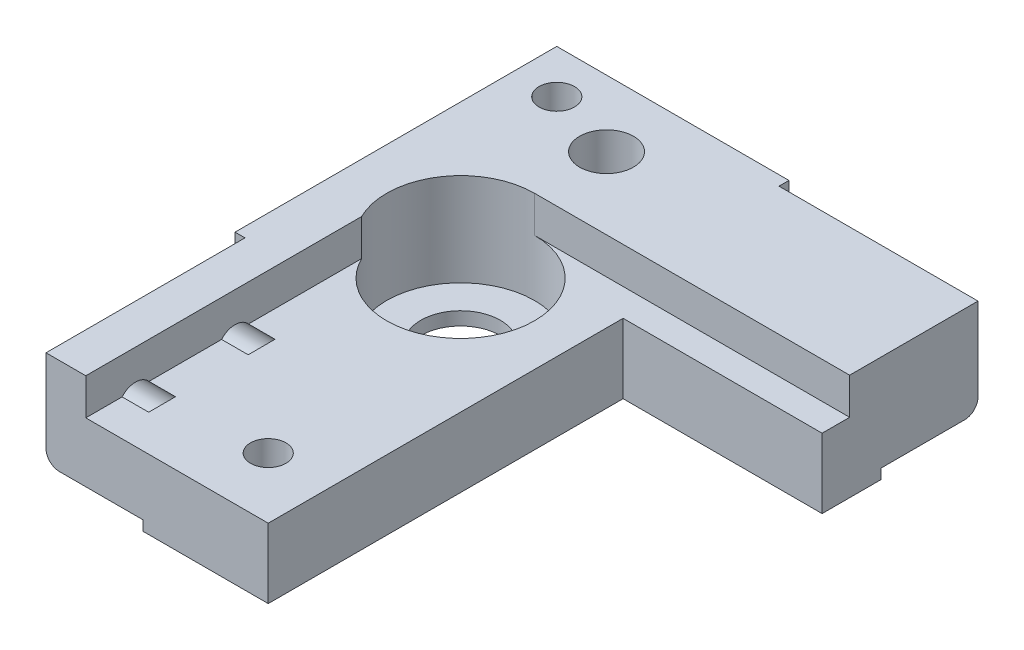
ISO-10303-21;
HEADER;
FILE_DESCRIPTION(('STEP AP214'),'2;1');
FILE_NAME('part.step','',(''),(''),'','','');
FILE_SCHEMA(('AUTOMOTIVE_DESIGN { 1 0 10303 214 1 1 1 1 }'));
ENDSEC;
DATA;
#1=APPLICATION_CONTEXT('core data for automotive mechanical design processes');
#2=APPLICATION_PROTOCOL_DEFINITION('international standard','automotive_design',2000,#1);
#3=PRODUCT_CONTEXT('',#1,'mechanical');
#4=PRODUCT('Part','Part','',(#3));
#5=PRODUCT_RELATED_PRODUCT_CATEGORY('part','',(#4));
#6=PRODUCT_DEFINITION_FORMATION('','',#4);
#7=PRODUCT_DEFINITION_CONTEXT('part definition',#1,'design');
#8=PRODUCT_DEFINITION('design','',#6,#7);
#9=PRODUCT_DEFINITION_SHAPE('','',#8);
#10=(LENGTH_UNIT() NAMED_UNIT(*) SI_UNIT(.MILLI.,.METRE.));
#11=(NAMED_UNIT(*) PLANE_ANGLE_UNIT() SI_UNIT($,.RADIAN.));
#12=(NAMED_UNIT(*) SI_UNIT($,.STERADIAN.) SOLID_ANGLE_UNIT());
#13=UNCERTAINTY_MEASURE_WITH_UNIT(LENGTH_MEASURE(1.E-05),#10,'distance_accuracy_value','');
#14=(GEOMETRIC_REPRESENTATION_CONTEXT(3) GLOBAL_UNCERTAINTY_ASSIGNED_CONTEXT((#13)) GLOBAL_UNIT_ASSIGNED_CONTEXT((#10,
#11,#12)) REPRESENTATION_CONTEXT('',''));
#15=CARTESIAN_POINT('',(0.,0.,0.));
#16=DIRECTION('',(0.,0.,1.));
#17=DIRECTION('',(1.,0.,0.));
#18=AXIS2_PLACEMENT_3D('',#15,#16,#17);
#19=CARTESIAN_POINT('',(35.,16.,78.5));
#20=DIRECTION('',(-1.,0.,0.));
#21=DIRECTION('',(0.,0.,1.));
#22=AXIS2_PLACEMENT_3D('',#19,#20,#21);
#23=PLANE('',#22);
#24=DIRECTION('',(0.,0.,-1.));
#25=VECTOR('',#24,1.);
#26=CARTESIAN_POINT('',(35.,10.5,78.5));
#27=LINE('',#26,#25);
#28=CARTESIAN_POINT('',(35.,10.5,78.5));
#29=VERTEX_POINT('',#28);
#30=CARTESIAN_POINT('',(35.,10.5,25.));
#31=VERTEX_POINT('',#30);
#32=EDGE_CURVE('E195',#29,#31,#27,.T.);
#33=ORIENTED_EDGE('',*,*,#32,.F.);
#34=DIRECTION('',(0.,-1.,0.));
#35=VECTOR('',#34,1.);
#36=CARTESIAN_POINT('',(35.,16.,78.5));
#37=LINE('',#36,#35);
#38=CARTESIAN_POINT('',(35.,0.,78.5));
#39=VERTEX_POINT('',#38);
#40=EDGE_CURVE('E220',#29,#39,#37,.T.);
#41=ORIENTED_EDGE('',*,*,#40,.T.);
#42=DIRECTION('',(0.,0.,-1.));
#43=VECTOR('',#42,1.);
#44=CARTESIAN_POINT('',(35.,0.,78.5));
#45=LINE('',#44,#43);
#46=CARTESIAN_POINT('',(35.,0.,25.));
#47=VERTEX_POINT('',#46);
#48=EDGE_CURVE('E218',#39,#47,#45,.T.);
#49=ORIENTED_EDGE('',*,*,#48,.T.);
#50=DIRECTION('',(0.,-1.,0.));
#51=VECTOR('',#50,1.);
#52=CARTESIAN_POINT('',(35.,16.,25.));
#53=LINE('',#52,#51);
#54=EDGE_CURVE('E212',#31,#47,#53,.T.);
#55=ORIENTED_EDGE('',*,*,#54,.F.);
#56=EDGE_LOOP('',(#33,#41,#49,#55));
#57=FACE_BOUND('',#56,.T.);
#58=ADVANCED_FACE('F34',(#57),#23,.F.);
#59=CARTESIAN_POINT('',(35.,16.,25.));
#60=DIRECTION('',(0.,0.,-1.));
#61=DIRECTION('',(-1.,0.,0.));
#62=AXIS2_PLACEMENT_3D('',#59,#60,#61);
#63=PLANE('',#62);
#64=DIRECTION('',(1.,0.,0.));
#65=VECTOR('',#64,1.);
#66=CARTESIAN_POINT('',(65.,10.5,25.));
#67=LINE('',#66,#65);
#68=CARTESIAN_POINT('',(65.,10.5,25.));
#69=VERTEX_POINT('',#68);
#70=EDGE_CURVE('E199',#31,#69,#67,.T.);
#71=ORIENTED_EDGE('',*,*,#70,.F.);
#72=ORIENTED_EDGE('',*,*,#54,.T.);
#73=DIRECTION('',(1.,0.,0.));
#74=VECTOR('',#73,1.);
#75=CARTESIAN_POINT('',(35.,0.,25.));
#76=LINE('',#75,#74);
#77=CARTESIAN_POINT('',(65.,0.,25.));
#78=VERTEX_POINT('',#77);
#79=EDGE_CURVE('E336',#47,#78,#76,.T.);
#80=ORIENTED_EDGE('',*,*,#79,.T.);
#81=DIRECTION('',(0.,-1.,0.));
#82=VECTOR('',#81,1.);
#83=CARTESIAN_POINT('',(65.,16.,25.));
#84=LINE('',#83,#82);
#85=EDGE_CURVE('E214',#69,#78,#84,.T.);
#86=ORIENTED_EDGE('',*,*,#85,.F.);
#87=EDGE_LOOP('',(#71,#72,#80,#86));
#88=FACE_BOUND('',#87,.T.);
#89=ADVANCED_FACE('F210',(#88),#63,.F.);
#90=CARTESIAN_POINT('',(11.5,8.75,56.));
#91=DIRECTION('',(-1.,0.,0.));
#92=DIRECTION('',(0.,-1.,0.));
#93=AXIS2_PLACEMENT_3D('',#90,#91,#92);
#94=CYLINDRICAL_SURFACE('',#93,2.675);
#95=CARTESIAN_POINT('',(1.5,8.75,56.));
#96=DIRECTION('',(-1.,0.,0.));
#97=DIRECTION('',(0.,-1.,0.));
#98=AXIS2_PLACEMENT_3D('',#95,#96,#97);
#99=CIRCLE('',#98,2.675);
#100=CARTESIAN_POINT('',(1.5,6.075,56.));
#101=VERTEX_POINT('',#100);
#102=EDGE_CURVE('E370',#101,#101,#99,.T.);
#103=ORIENTED_EDGE('',*,*,#102,.T.);
#104=EDGE_LOOP('',(#103));
#105=FACE_BOUND('',#104,.T.);
#106=DIRECTION('',(-1.,0.,0.));
#107=VECTOR('',#106,1.);
#108=CARTESIAN_POINT('',(11.5,10.5,53.9768526993815));
#109=LINE('',#108,#107);
#110=CARTESIAN_POINT('',(7.50000000000001,10.5,53.9768526993815));
#111=VERTEX_POINT('',#110);
#112=CARTESIAN_POINT('',(11.5,10.5,53.9768526993815));
#113=VERTEX_POINT('',#112);
#114=EDGE_CURVE('E600',#111,#113,#109,.F.);
#115=ORIENTED_EDGE('',*,*,#114,.F.);
#116=CARTESIAN_POINT('',(7.50000000000001,8.75,56.));
#117=DIRECTION('',(-1.,0.,0.));
#118=DIRECTION('',(0.,0.,1.));
#119=AXIS2_PLACEMENT_3D('',#116,#117,#118);
#120=CIRCLE('',#119,2.675);
#121=CARTESIAN_POINT('',(7.50000000000001,10.5,58.0231473006185));
#122=VERTEX_POINT('',#121);
#123=EDGE_CURVE('E604',#111,#122,#120,.F.);
#124=ORIENTED_EDGE('',*,*,#123,.T.);
#125=DIRECTION('',(-1.,0.,0.));
#126=VECTOR('',#125,1.);
#127=CARTESIAN_POINT('',(11.5,10.5,58.0231473006185));
#128=LINE('',#127,#126);
#129=CARTESIAN_POINT('',(11.5,10.5,58.0231473006185));
#130=VERTEX_POINT('',#129);
#131=EDGE_CURVE('E598',#130,#122,#128,.T.);
#132=ORIENTED_EDGE('',*,*,#131,.F.);
#133=CARTESIAN_POINT('',(11.5,8.75,56.));
#134=DIRECTION('',(-1.,0.,0.));
#135=DIRECTION('',(0.,-1.,0.));
#136=AXIS2_PLACEMENT_3D('',#133,#134,#135);
#137=CIRCLE('',#136,2.675);
#138=EDGE_CURVE('E381',#113,#130,#137,.T.);
#139=ORIENTED_EDGE('',*,*,#138,.F.);
#140=EDGE_LOOP('',(#115,#124,#132,#139));
#141=FACE_BOUND('',#140,.T.);
#142=ADVANCED_FACE('F421',(#105,#141),#94,.F.);
#143=CARTESIAN_POINT('',(11.5,8.75,56.));
#144=DIRECTION('',(-1.,0.,0.));
#145=DIRECTION('',(0.,-1.,0.));
#146=AXIS2_PLACEMENT_3D('',#143,#144,#145);
#147=PLANE('',#146);
#148=ORIENTED_EDGE('',*,*,#138,.T.);
#149=DIRECTION('',(0.,0.,-1.));
#150=VECTOR('',#149,1.);
#151=CARTESIAN_POINT('',(11.5,10.5,56.));
#152=LINE('',#151,#150);
#153=EDGE_CURVE('E596',#130,#113,#152,.T.);
#154=ORIENTED_EDGE('',*,*,#153,.T.);
#155=EDGE_LOOP('',(#148,#154));
#156=FACE_BOUND('',#155,.T.);
#157=ADVANCED_FACE('F460',(#156),#147,.T.);
#158=CARTESIAN_POINT('',(11.5,8.75,71.));
#159=DIRECTION('',(-1.,0.,0.));
#160=DIRECTION('',(0.,-1.,0.));
#161=AXIS2_PLACEMENT_3D('',#158,#159,#160);
#162=CYLINDRICAL_SURFACE('',#161,2.675);
#163=CARTESIAN_POINT('',(1.5,8.75,71.));
#164=DIRECTION('',(-1.,0.,0.));
#165=DIRECTION('',(0.,-1.,0.));
#166=AXIS2_PLACEMENT_3D('',#163,#164,#165);
#167=CIRCLE('',#166,2.675);
#168=CARTESIAN_POINT('',(1.5,6.075,71.));
#169=VERTEX_POINT('',#168);
#170=EDGE_CURVE('E546',#169,#169,#167,.T.);
#171=ORIENTED_EDGE('',*,*,#170,.T.);
#172=EDGE_LOOP('',(#171));
#173=FACE_BOUND('',#172,.T.);
#174=DIRECTION('',(-1.,0.,0.));
#175=VECTOR('',#174,1.);
#176=CARTESIAN_POINT('',(11.5,10.5,68.9768526993815));
#177=LINE('',#176,#175);
#178=CARTESIAN_POINT('',(7.50000000000001,10.5,68.9768526993815));
#179=VERTEX_POINT('',#178);
#180=CARTESIAN_POINT('',(11.5,10.5,68.9768526993815));
#181=VERTEX_POINT('',#180);
#182=EDGE_CURVE('E594',#179,#181,#177,.F.);
#183=ORIENTED_EDGE('',*,*,#182,.F.);
#184=CARTESIAN_POINT('',(7.50000000000001,8.75,71.));
#185=DIRECTION('',(-1.,0.,0.));
#186=DIRECTION('',(0.,0.,1.));
#187=AXIS2_PLACEMENT_3D('',#184,#185,#186);
#188=CIRCLE('',#187,2.675);
#189=CARTESIAN_POINT('',(7.50000000000001,10.5,73.0231473006185));
#190=VERTEX_POINT('',#189);
#191=EDGE_CURVE('E233',#179,#190,#188,.F.);
#192=ORIENTED_EDGE('',*,*,#191,.T.);
#193=DIRECTION('',(-1.,0.,0.));
#194=VECTOR('',#193,1.);
#195=CARTESIAN_POINT('',(11.5,10.5,73.0231473006185));
#196=LINE('',#195,#194);
#197=CARTESIAN_POINT('',(11.5,10.5,73.0231473006185));
#198=VERTEX_POINT('',#197);
#199=EDGE_CURVE('E592',#198,#190,#196,.T.);
#200=ORIENTED_EDGE('',*,*,#199,.F.);
#201=CARTESIAN_POINT('',(11.5,8.75,71.));
#202=DIRECTION('',(-1.,0.,0.));
#203=DIRECTION('',(0.,-1.,0.));
#204=AXIS2_PLACEMENT_3D('',#201,#202,#203);
#205=CIRCLE('',#204,2.675);
#206=EDGE_CURVE('E550',#181,#198,#205,.T.);
#207=ORIENTED_EDGE('',*,*,#206,.F.);
#208=EDGE_LOOP('',(#183,#192,#200,#207));
#209=FACE_BOUND('',#208,.T.);
#210=ADVANCED_FACE('F456',(#173,#209),#162,.F.);
#211=CARTESIAN_POINT('',(11.5,8.75,71.));
#212=DIRECTION('',(-1.,0.,0.));
#213=DIRECTION('',(0.,-1.,0.));
#214=AXIS2_PLACEMENT_3D('',#211,#212,#213);
#215=PLANE('',#214);
#216=ORIENTED_EDGE('',*,*,#206,.T.);
#217=DIRECTION('',(0.,0.,-1.));
#218=VECTOR('',#217,1.);
#219=CARTESIAN_POINT('',(11.5,10.5,71.));
#220=LINE('',#219,#218);
#221=EDGE_CURVE('E237',#198,#181,#220,.T.);
#222=ORIENTED_EDGE('',*,*,#221,.T.);
#223=EDGE_LOOP('',(#216,#222));
#224=FACE_BOUND('',#223,.T.);
#225=ADVANCED_FACE('F447',(#224),#215,.T.);
#226=CARTESIAN_POINT('',(25.8455481504227,0.,69.3455481504227));
#227=DIRECTION('',(0.,1.,0.));
#228=DIRECTION('',(0.,0.,1.));
#229=AXIS2_PLACEMENT_3D('',#226,#227,#228);
#230=CYLINDRICAL_SURFACE('',#229,2.675);
#231=CARTESIAN_POINT('',(25.8455481504227,0.,69.3455481504227));
#232=DIRECTION('',(0.,1.,0.));
#233=DIRECTION('',(0.,0.,1.));
#234=AXIS2_PLACEMENT_3D('',#231,#232,#233);
#235=CIRCLE('',#234,2.675);
#236=CARTESIAN_POINT('',(25.8455481504227,0.,72.0205481504227));
#237=VERTEX_POINT('',#236);
#238=EDGE_CURVE('E530',#237,#237,#235,.T.);
#239=ORIENTED_EDGE('',*,*,#238,.F.);
#240=EDGE_LOOP('',(#239));
#241=FACE_BOUND('',#240,.T.);
#242=CARTESIAN_POINT('',(25.8455481504227,10.5,69.3455481504227));
#243=DIRECTION('',(0.,1.,0.));
#244=DIRECTION('',(0.,0.,1.));
#245=AXIS2_PLACEMENT_3D('',#242,#243,#244);
#246=CIRCLE('',#245,2.675);
#247=CARTESIAN_POINT('',(25.8455481504227,10.5,72.0205481504227));
#248=VERTEX_POINT('',#247);
#249=EDGE_CURVE('E234',#248,#248,#246,.F.);
#250=ORIENTED_EDGE('',*,*,#249,.F.);
#251=EDGE_LOOP('',(#250));
#252=FACE_BOUND('',#251,.T.);
#253=ADVANCED_FACE('F427',(#241,#252),#230,.F.);
#254=CARTESIAN_POINT('',(0.,16.,0.));
#255=DIRECTION('',(1.,0.,0.));
#256=DIRECTION('',(0.,0.,-1.));
#257=AXIS2_PLACEMENT_3D('',#254,#255,#256);
#258=PLANE('',#257);
#259=DIRECTION('',(0.,0.,1.));
#260=VECTOR('',#259,1.);
#261=CARTESIAN_POINT('',(0.,0.,0.));
#262=LINE('',#261,#260);
#263=CARTESIAN_POINT('',(0.,0.,0.));
#264=VERTEX_POINT('',#263);
#265=CARTESIAN_POINT('',(0.,0.,48.5));
#266=VERTEX_POINT('',#265);
#267=EDGE_CURVE('E317',#264,#266,#262,.T.);
#268=ORIENTED_EDGE('',*,*,#267,.T.);
#269=DIRECTION('',(0.,-1.,0.));
#270=VECTOR('',#269,1.);
#271=CARTESIAN_POINT('',(0.,0.,48.5));
#272=LINE('',#271,#270);
#273=CARTESIAN_POINT('',(0.,16.,48.5));
#274=VERTEX_POINT('',#273);
#275=EDGE_CURVE('E376',#274,#266,#272,.T.);
#276=ORIENTED_EDGE('',*,*,#275,.F.);
#277=DIRECTION('',(0.,0.,1.));
#278=VECTOR('',#277,1.);
#279=CARTESIAN_POINT('',(0.,16.,0.));
#280=LINE('',#279,#278);
#281=CARTESIAN_POINT('',(0.,16.,0.));
#282=VERTEX_POINT('',#281);
#283=EDGE_CURVE('E319',#282,#274,#280,.T.);
#284=ORIENTED_EDGE('',*,*,#283,.F.);
#285=DIRECTION('',(0.,-1.,0.));
#286=VECTOR('',#285,1.);
#287=CARTESIAN_POINT('',(0.,16.,0.));
#288=LINE('',#287,#286);
#289=EDGE_CURVE('E224',#282,#264,#288,.T.);
#290=ORIENTED_EDGE('',*,*,#289,.T.);
#291=EDGE_LOOP('',(#268,#276,#284,#290));
#292=FACE_BOUND('',#291,.T.);
#293=ADVANCED_FACE('F346',(#292),#258,.F.);
#294=CARTESIAN_POINT('',(0.,16.,78.5));
#295=DIRECTION('',(0.,0.,-1.));
#296=DIRECTION('',(-1.,0.,0.));
#297=AXIS2_PLACEMENT_3D('',#294,#295,#296);
#298=PLANE('',#297);
#299=DIRECTION('',(0.,1.,0.));
#300=VECTOR('',#299,1.);
#301=CARTESIAN_POINT('',(1.5,16.1,78.5));
#302=LINE('',#301,#300);
#303=CARTESIAN_POINT('',(1.5,3.5,78.5));
#304=VERTEX_POINT('',#303);
#305=CARTESIAN_POINT('',(1.5,16.,78.5));
#306=VERTEX_POINT('',#305);
#307=EDGE_CURVE('E363',#304,#306,#302,.T.);
#308=ORIENTED_EDGE('',*,*,#307,.F.);
#309=CARTESIAN_POINT('',(3.5,3.5,78.5));
#310=DIRECTION('',(0.,0.,-1.));
#311=DIRECTION('',(-1.,0.,0.));
#312=AXIS2_PLACEMENT_3D('',#309,#310,#311);
#313=CIRCLE('',#312,2.);
#314=CARTESIAN_POINT('',(3.5,1.5,78.5));
#315=VERTEX_POINT('',#314);
#316=EDGE_CURVE('E57',#304,#315,#313,.F.);
#317=ORIENTED_EDGE('',*,*,#316,.T.);
#318=DIRECTION('',(-1.,0.,0.));
#319=VECTOR('',#318,1.);
#320=CARTESIAN_POINT('',(1.5,1.5,78.5));
#321=LINE('',#320,#319);
#322=CARTESIAN_POINT('',(16.1,1.5,78.5));
#323=VERTEX_POINT('',#322);
#324=EDGE_CURVE('E367',#323,#315,#321,.T.);
#325=ORIENTED_EDGE('',*,*,#324,.F.);
#326=DIRECTION('',(0.,1.,0.));
#327=VECTOR('',#326,1.);
#328=CARTESIAN_POINT('',(16.1,1.5,78.5));
#329=LINE('',#328,#327);
#330=CARTESIAN_POINT('',(16.1,0.,78.5));
#331=VERTEX_POINT('',#330);
#332=EDGE_CURVE('E378',#331,#323,#329,.T.);
#333=ORIENTED_EDGE('',*,*,#332,.F.);
#334=DIRECTION('',(1.,0.,0.));
#335=VECTOR('',#334,1.);
#336=CARTESIAN_POINT('',(0.,0.,78.5));
#337=LINE('',#336,#335);
#338=EDGE_CURVE('E332',#331,#39,#337,.T.);
#339=ORIENTED_EDGE('',*,*,#338,.T.);
#340=ORIENTED_EDGE('',*,*,#40,.F.);
#341=DIRECTION('',(1.,0.,0.));
#342=VECTOR('',#341,1.);
#343=CARTESIAN_POINT('',(35.,10.5,78.5));
#344=LINE('',#343,#342);
#345=CARTESIAN_POINT('',(7.50000000000001,10.5,78.5));
#346=VERTEX_POINT('',#345);
#347=EDGE_CURVE('E202',#346,#29,#344,.T.);
#348=ORIENTED_EDGE('',*,*,#347,.F.);
#349=DIRECTION('',(0.,1.,0.));
#350=VECTOR('',#349,1.);
#351=CARTESIAN_POINT('',(7.50000000000001,10.5,78.5));
#352=LINE('',#351,#350);
#353=CARTESIAN_POINT('',(7.50000000000001,16.,78.5));
#354=VERTEX_POINT('',#353);
#355=EDGE_CURVE('E238',#346,#354,#352,.T.);
#356=ORIENTED_EDGE('',*,*,#355,.T.);
#357=DIRECTION('',(1.,0.,0.));
#358=VECTOR('',#357,1.);
#359=CARTESIAN_POINT('',(0.,16.,78.5));
#360=LINE('',#359,#358);
#361=EDGE_CURVE('E322',#306,#354,#360,.T.);
#362=ORIENTED_EDGE('',*,*,#361,.F.);
#363=EDGE_LOOP('',(#308,#317,#325,#333,#339,#340,#348,#356,#362));
#364=FACE_BOUND('',#363,.T.);
#365=ADVANCED_FACE('F413',(#364),#298,.F.);
#366=CARTESIAN_POINT('',(65.,16.,0.));
#367=DIRECTION('',(-1.,0.,0.));
#368=DIRECTION('',(0.,0.,1.));
#369=AXIS2_PLACEMENT_3D('',#366,#367,#368);
#370=PLANE('',#369);
#371=DIRECTION('',(0.,0.,1.));
#372=VECTOR('',#371,1.);
#373=CARTESIAN_POINT('',(65.,1.5,16.1));
#374=LINE('',#373,#372);
#375=CARTESIAN_POINT('',(65.,1.5,3.49999999999999));
#376=VERTEX_POINT('',#375);
#377=CARTESIAN_POINT('',(65.,1.5,16.1));
#378=VERTEX_POINT('',#377);
#379=EDGE_CURVE('E280',#376,#378,#374,.T.);
#380=ORIENTED_EDGE('',*,*,#379,.F.);
#381=CARTESIAN_POINT('',(65.,3.5,3.49999999999999));
#382=DIRECTION('',(-1.,0.,0.));
#383=DIRECTION('',(0.,0.,1.));
#384=AXIS2_PLACEMENT_3D('',#381,#382,#383);
#385=CIRCLE('',#384,2.);
#386=CARTESIAN_POINT('',(65.,3.5,1.49999999999999));
#387=VERTEX_POINT('',#386);
#388=EDGE_CURVE('E244',#376,#387,#385,.F.);
#389=ORIENTED_EDGE('',*,*,#388,.T.);
#390=DIRECTION('',(0.,-1.,0.));
#391=VECTOR('',#390,1.);
#392=CARTESIAN_POINT('',(65.,1.5,1.49999999999999));
#393=LINE('',#392,#391);
#394=CARTESIAN_POINT('',(65.,16.,1.49999999999999));
#395=VERTEX_POINT('',#394);
#396=EDGE_CURVE('E278',#395,#387,#393,.T.);
#397=ORIENTED_EDGE('',*,*,#396,.F.);
#398=DIRECTION('',(0.,0.,-1.));
#399=VECTOR('',#398,1.);
#400=CARTESIAN_POINT('',(65.,16.,0.));
#401=LINE('',#400,#399);
#402=CARTESIAN_POINT('',(65.,16.,20.85));
#403=VERTEX_POINT('',#402);
#404=EDGE_CURVE('E326',#403,#395,#401,.T.);
#405=ORIENTED_EDGE('',*,*,#404,.F.);
#406=DIRECTION('',(0.,1.,0.));
#407=VECTOR('',#406,1.);
#408=CARTESIAN_POINT('',(65.,10.5,20.85));
#409=LINE('',#408,#407);
#410=CARTESIAN_POINT('',(65.,10.5,20.85));
#411=VERTEX_POINT('',#410);
#412=EDGE_CURVE('E588',#411,#403,#409,.T.);
#413=ORIENTED_EDGE('',*,*,#412,.F.);
#414=DIRECTION('',(0.,0.,-1.));
#415=VECTOR('',#414,1.);
#416=CARTESIAN_POINT('',(65.,10.5,20.85));
#417=LINE('',#416,#415);
#418=EDGE_CURVE('E215',#69,#411,#417,.T.);
#419=ORIENTED_EDGE('',*,*,#418,.F.);
#420=ORIENTED_EDGE('',*,*,#85,.T.);
#421=DIRECTION('',(0.,0.,-1.));
#422=VECTOR('',#421,1.);
#423=CARTESIAN_POINT('',(65.,0.,0.));
#424=LINE('',#423,#422);
#425=CARTESIAN_POINT('',(65.,0.,16.1));
#426=VERTEX_POINT('',#425);
#427=EDGE_CURVE('E338',#78,#426,#424,.T.);
#428=ORIENTED_EDGE('',*,*,#427,.T.);
#429=DIRECTION('',(0.,-1.,0.));
#430=VECTOR('',#429,1.);
#431=CARTESIAN_POINT('',(65.,0.,16.1));
#432=LINE('',#431,#430);
#433=EDGE_CURVE('E286',#378,#426,#432,.T.);
#434=ORIENTED_EDGE('',*,*,#433,.F.);
#435=EDGE_LOOP('',(#380,#389,#397,#405,#413,#419,#420,#428,#434));
#436=FACE_BOUND('',#435,.T.);
#437=ADVANCED_FACE('F276',(#436),#370,.F.);
#438=CARTESIAN_POINT('',(0.,16.,0.));
#439=DIRECTION('',(0.,0.,1.));
#440=DIRECTION('',(1.,0.,0.));
#441=AXIS2_PLACEMENT_3D('',#438,#439,#440);
#442=PLANE('',#441);
#443=DIRECTION('',(-1.,0.,0.));
#444=VECTOR('',#443,1.);
#445=CARTESIAN_POINT('',(0.,16.,0.));
#446=LINE('',#445,#444);
#447=CARTESIAN_POINT('',(35.,16.,0.));
#448=VERTEX_POINT('',#447);
#449=EDGE_CURVE('E328',#448,#282,#446,.T.);
#450=ORIENTED_EDGE('',*,*,#449,.F.);
#451=DIRECTION('',(0.,1.,0.));
#452=VECTOR('',#451,1.);
#453=CARTESIAN_POINT('',(35.,16.1,0.));
#454=LINE('',#453,#452);
#455=CARTESIAN_POINT('',(35.,0.,0.));
#456=VERTEX_POINT('',#455);
#457=EDGE_CURVE('E397',#456,#448,#454,.T.);
#458=ORIENTED_EDGE('',*,*,#457,.F.);
#459=DIRECTION('',(-1.,0.,0.));
#460=VECTOR('',#459,1.);
#461=CARTESIAN_POINT('',(0.,0.,0.));
#462=LINE('',#461,#460);
#463=EDGE_CURVE('E323',#456,#264,#462,.T.);
#464=ORIENTED_EDGE('',*,*,#463,.T.);
#465=ORIENTED_EDGE('',*,*,#289,.F.);
#466=EDGE_LOOP('',(#450,#458,#464,#465));
#467=FACE_BOUND('',#466,.T.);
#468=ADVANCED_FACE('F405',(#467),#442,.F.);
#469=CARTESIAN_POINT('',(0.,16.,0.));
#470=DIRECTION('',(0.,1.,0.));
#471=DIRECTION('',(0.,0.,1.));
#472=AXIS2_PLACEMENT_3D('',#469,#470,#471);
#473=PLANE('',#472);
#474=DIRECTION('',(0.,0.,1.));
#475=VECTOR('',#474,1.);
#476=CARTESIAN_POINT('',(7.50000000000001,16.,78.5));
#477=LINE('',#476,#475);
#478=CARTESIAN_POINT('',(7.50000000000001,16.,36.9317846668321));
#479=VERTEX_POINT('',#478);
#480=EDGE_CURVE('E206',#479,#354,#477,.T.);
#481=ORIENTED_EDGE('',*,*,#480,.F.);
#482=CARTESIAN_POINT('',(17.5,16.,32.));
#483=DIRECTION('',(0.,1.,0.));
#484=DIRECTION('',(0.,0.,1.));
#485=AXIS2_PLACEMENT_3D('',#482,#483,#484);
#486=CIRCLE('',#485,11.15);
#487=CARTESIAN_POINT('',(17.5,16.,20.85));
#488=VERTEX_POINT('',#487);
#489=EDGE_CURVE('E311',#488,#479,#486,.T.);
#490=ORIENTED_EDGE('',*,*,#489,.F.);
#491=DIRECTION('',(-1.,0.,0.));
#492=VECTOR('',#491,1.);
#493=CARTESIAN_POINT('',(17.5,16.,20.85));
#494=LINE('',#493,#492);
#495=EDGE_CURVE('E579',#403,#488,#494,.T.);
#496=ORIENTED_EDGE('',*,*,#495,.F.);
#497=ORIENTED_EDGE('',*,*,#404,.T.);
#498=DIRECTION('',(1.,0.,0.));
#499=VECTOR('',#498,1.);
#500=CARTESIAN_POINT('',(0.,16.,1.49999999999999));
#501=LINE('',#500,#499);
#502=CARTESIAN_POINT('',(35.,16.,1.49999999999999));
#503=VERTEX_POINT('',#502);
#504=EDGE_CURVE('E222',#503,#395,#501,.T.);
#505=ORIENTED_EDGE('',*,*,#504,.F.);
#506=DIRECTION('',(0.,0.,1.));
#507=VECTOR('',#506,1.);
#508=CARTESIAN_POINT('',(35.,16.,0.));
#509=LINE('',#508,#507);
#510=EDGE_CURVE('E298',#448,#503,#509,.T.);
#511=ORIENTED_EDGE('',*,*,#510,.F.);
#512=ORIENTED_EDGE('',*,*,#449,.T.);
#513=ORIENTED_EDGE('',*,*,#283,.T.);
#514=DIRECTION('',(-1.,0.,0.));
#515=VECTOR('',#514,1.);
#516=CARTESIAN_POINT('',(0.,16.,48.5));
#517=LINE('',#516,#515);
#518=CARTESIAN_POINT('',(1.5,16.,48.5));
#519=VERTEX_POINT('',#518);
#520=EDGE_CURVE('E385',#519,#274,#517,.T.);
#521=ORIENTED_EDGE('',*,*,#520,.F.);
#522=DIRECTION('',(0.,0.,-1.));
#523=VECTOR('',#522,1.);
#524=CARTESIAN_POINT('',(1.5,16.,0.));
#525=LINE('',#524,#523);
#526=EDGE_CURVE('E230',#306,#519,#525,.T.);
#527=ORIENTED_EDGE('',*,*,#526,.F.);
#528=ORIENTED_EDGE('',*,*,#361,.T.);
#529=EDGE_LOOP('',(#481,#490,#496,#497,#505,#511,#512,#513,#521,#527,#528));
#530=FACE_BOUND('',#529,.T.);
#531=CARTESIAN_POINT('',(6.58093689720364,16.,6.58093689720363));
#532=DIRECTION('',(0.,1.,0.));
#533=DIRECTION('',(0.,0.,1.));
#534=AXIS2_PLACEMENT_3D('',#531,#532,#533);
#535=CIRCLE('',#534,2.675);
#536=CARTESIAN_POINT('',(6.58093689720364,16.,9.25593689720364));
#537=VERTEX_POINT('',#536);
#538=EDGE_CURVE('E547',#537,#537,#535,.T.);
#539=ORIENTED_EDGE('',*,*,#538,.F.);
#540=EDGE_LOOP('',(#539));
#541=FACE_BOUND('',#540,.T.);
#542=CARTESIAN_POINT('',(17.5,16.,10.));
#543=DIRECTION('',(0.,1.,0.));
#544=DIRECTION('',(0.,0.,1.));
#545=AXIS2_PLACEMENT_3D('',#542,#543,#544);
#546=CIRCLE('',#545,4.04999999999999);
#547=CARTESIAN_POINT('',(17.5,16.,14.05));
#548=VERTEX_POINT('',#547);
#549=EDGE_CURVE('E301',#548,#548,#546,.T.);
#550=ORIENTED_EDGE('',*,*,#549,.F.);
#551=EDGE_LOOP('',(#550));
#552=FACE_BOUND('',#551,.T.);
#553=ADVANCED_FACE('F403',(#530,#541,#552),#473,.T.);
#554=CARTESIAN_POINT('',(0.,0.,0.));
#555=DIRECTION('',(0.,1.,0.));
#556=DIRECTION('',(0.,0.,1.));
#557=AXIS2_PLACEMENT_3D('',#554,#555,#556);
#558=PLANE('',#557);
#559=ORIENTED_EDGE('',*,*,#238,.T.);
#560=EDGE_LOOP('',(#559));
#561=FACE_BOUND('',#560,.T.);
#562=CARTESIAN_POINT('',(6.58093689720364,0.,6.58093689720363));
#563=DIRECTION('',(0.,1.,0.));
#564=DIRECTION('',(0.,0.,1.));
#565=AXIS2_PLACEMENT_3D('',#562,#563,#564);
#566=CIRCLE('',#565,2.675);
#567=CARTESIAN_POINT('',(6.58093689720364,0.,9.25593689720364));
#568=VERTEX_POINT('',#567);
#569=EDGE_CURVE('E534',#568,#568,#566,.T.);
#570=ORIENTED_EDGE('',*,*,#569,.T.);
#571=EDGE_LOOP('',(#570));
#572=FACE_BOUND('',#571,.T.);
#573=CARTESIAN_POINT('',(17.5,0.,10.));
#574=DIRECTION('',(0.,1.,0.));
#575=DIRECTION('',(0.,0.,1.));
#576=AXIS2_PLACEMENT_3D('',#573,#574,#575);
#577=CIRCLE('',#576,4.04999999999999);
#578=CARTESIAN_POINT('',(17.5,0.,14.05));
#579=VERTEX_POINT('',#578);
#580=EDGE_CURVE('E302',#579,#579,#577,.T.);
#581=ORIENTED_EDGE('',*,*,#580,.T.);
#582=EDGE_LOOP('',(#581));
#583=FACE_BOUND('',#582,.T.);
#584=CARTESIAN_POINT('',(17.5,0.,32.));
#585=DIRECTION('',(0.,1.,0.));
#586=DIRECTION('',(0.,0.,1.));
#587=AXIS2_PLACEMENT_3D('',#584,#585,#586);
#588=CIRCLE('',#587,6.);
#589=CARTESIAN_POINT('',(17.5,0.,38.));
#590=VERTEX_POINT('',#589);
#591=EDGE_CURVE('E308',#590,#590,#588,.T.);
#592=ORIENTED_EDGE('',*,*,#591,.T.);
#593=EDGE_LOOP('',(#592));
#594=FACE_BOUND('',#593,.T.);
#595=ORIENTED_EDGE('',*,*,#338,.F.);
#596=DIRECTION('',(0.,0.,1.));
#597=VECTOR('',#596,1.);
#598=CARTESIAN_POINT('',(16.1,0.,48.5));
#599=LINE('',#598,#597);
#600=CARTESIAN_POINT('',(16.1,0.,48.5));
#601=VERTEX_POINT('',#600);
#602=EDGE_CURVE('E359',#601,#331,#599,.T.);
#603=ORIENTED_EDGE('',*,*,#602,.F.);
#604=DIRECTION('',(1.,0.,0.));
#605=VECTOR('',#604,1.);
#606=CARTESIAN_POINT('',(16.1,0.,48.5));
#607=LINE('',#606,#605);
#608=EDGE_CURVE('E358',#266,#601,#607,.T.);
#609=ORIENTED_EDGE('',*,*,#608,.F.);
#610=ORIENTED_EDGE('',*,*,#267,.F.);
#611=ORIENTED_EDGE('',*,*,#463,.F.);
#612=DIRECTION('',(0.,0.,-1.));
#613=VECTOR('',#612,1.);
#614=CARTESIAN_POINT('',(35.,0.,0.));
#615=LINE('',#614,#613);
#616=CARTESIAN_POINT('',(35.,0.,16.1));
#617=VERTEX_POINT('',#616);
#618=EDGE_CURVE('E294',#617,#456,#615,.T.);
#619=ORIENTED_EDGE('',*,*,#618,.F.);
#620=DIRECTION('',(1.,0.,0.));
#621=VECTOR('',#620,1.);
#622=CARTESIAN_POINT('',(35.,0.,16.1));
#623=LINE('',#622,#621);
#624=EDGE_CURVE('E295',#617,#426,#623,.T.);
#625=ORIENTED_EDGE('',*,*,#624,.T.);
#626=ORIENTED_EDGE('',*,*,#427,.F.);
#627=ORIENTED_EDGE('',*,*,#79,.F.);
#628=ORIENTED_EDGE('',*,*,#48,.F.);
#629=EDGE_LOOP('',(#595,#603,#609,#610,#611,#619,#625,#626,#627,#628));
#630=FACE_BOUND('',#629,.T.);
#631=ADVANCED_FACE('F354',(#561,#572,#583,#594,#630),#558,.F.);
#632=CARTESIAN_POINT('',(17.5,2.,32.));
#633=DIRECTION('',(0.,1.,0.));
#634=DIRECTION('',(0.,0.,1.));
#635=AXIS2_PLACEMENT_3D('',#632,#633,#634);
#636=CYLINDRICAL_SURFACE('',#635,11.15);
#637=ORIENTED_EDGE('',*,*,#489,.T.);
#638=DIRECTION('',(0.,1.,0.));
#639=VECTOR('',#638,1.);
#640=CARTESIAN_POINT('',(7.50000000000001,2.,36.9317846668321));
#641=LINE('',#640,#639);
#642=CARTESIAN_POINT('',(7.50000000000001,10.5,36.9317846668321));
#643=VERTEX_POINT('',#642);
#644=EDGE_CURVE('E606',#479,#643,#641,.F.);
#645=ORIENTED_EDGE('',*,*,#644,.T.);
#646=CARTESIAN_POINT('',(17.5,10.5,32.));
#647=DIRECTION('',(0.,1.,0.));
#648=DIRECTION('',(0.,0.,1.));
#649=AXIS2_PLACEMENT_3D('',#646,#647,#648);
#650=CIRCLE('',#649,11.15);
#651=CARTESIAN_POINT('',(17.5,10.5,20.85));
#652=VERTEX_POINT('',#651);
#653=EDGE_CURVE('E602',#652,#643,#650,.F.);
#654=ORIENTED_EDGE('',*,*,#653,.F.);
#655=DIRECTION('',(0.,1.,0.));
#656=VECTOR('',#655,1.);
#657=CARTESIAN_POINT('',(17.5,10.5,20.85));
#658=LINE('',#657,#656);
#659=EDGE_CURVE('E585',#652,#488,#658,.T.);
#660=ORIENTED_EDGE('',*,*,#659,.T.);
#661=EDGE_LOOP('',(#637,#645,#654,#660));
#662=FACE_BOUND('',#661,.T.);
#663=CARTESIAN_POINT('',(17.5,2.,32.));
#664=DIRECTION('',(0.,1.,0.));
#665=DIRECTION('',(0.,0.,1.));
#666=AXIS2_PLACEMENT_3D('',#663,#664,#665);
#667=CIRCLE('',#666,11.15);
#668=CARTESIAN_POINT('',(17.5,2.,43.15));
#669=VERTEX_POINT('',#668);
#670=EDGE_CURVE('E314',#669,#669,#667,.T.);
#671=ORIENTED_EDGE('',*,*,#670,.F.);
#672=EDGE_LOOP('',(#671));
#673=FACE_BOUND('',#672,.T.);
#674=ADVANCED_FACE('F519',(#662,#673),#636,.F.);
#675=CARTESIAN_POINT('',(17.5,2.,32.));
#676=DIRECTION('',(0.,1.,0.));
#677=DIRECTION('',(0.,0.,1.));
#678=AXIS2_PLACEMENT_3D('',#675,#676,#677);
#679=PLANE('',#678);
#680=CARTESIAN_POINT('',(17.5,2.,32.));
#681=DIRECTION('',(0.,1.,0.));
#682=DIRECTION('',(0.,0.,1.));
#683=AXIS2_PLACEMENT_3D('',#680,#681,#682);
#684=CIRCLE('',#683,6.);
#685=CARTESIAN_POINT('',(17.5,2.,38.));
#686=VERTEX_POINT('',#685);
#687=EDGE_CURVE('E305',#686,#686,#684,.T.);
#688=ORIENTED_EDGE('',*,*,#687,.F.);
#689=EDGE_LOOP('',(#688));
#690=FACE_BOUND('',#689,.T.);
#691=ORIENTED_EDGE('',*,*,#670,.T.);
#692=EDGE_LOOP('',(#691));
#693=FACE_BOUND('',#692,.T.);
#694=ADVANCED_FACE('F515',(#690,#693),#679,.T.);
#695=CARTESIAN_POINT('',(17.5,0.,32.));
#696=DIRECTION('',(0.,1.,0.));
#697=DIRECTION('',(0.,0.,1.));
#698=AXIS2_PLACEMENT_3D('',#695,#696,#697);
#699=CYLINDRICAL_SURFACE('',#698,6.);
#700=ORIENTED_EDGE('',*,*,#591,.F.);
#701=EDGE_LOOP('',(#700));
#702=FACE_BOUND('',#701,.T.);
#703=ORIENTED_EDGE('',*,*,#687,.T.);
#704=EDGE_LOOP('',(#703));
#705=FACE_BOUND('',#704,.T.);
#706=ADVANCED_FACE('F511',(#702,#705),#699,.F.);
#707=CARTESIAN_POINT('',(17.5,0.,10.));
#708=DIRECTION('',(0.,1.,0.));
#709=DIRECTION('',(0.,0.,1.));
#710=AXIS2_PLACEMENT_3D('',#707,#708,#709);
#711=CYLINDRICAL_SURFACE('',#710,4.04999999999999);
#712=ORIENTED_EDGE('',*,*,#580,.F.);
#713=EDGE_LOOP('',(#712));
#714=FACE_BOUND('',#713,.T.);
#715=ORIENTED_EDGE('',*,*,#549,.T.);
#716=EDGE_LOOP('',(#715));
#717=FACE_BOUND('',#716,.T.);
#718=ADVANCED_FACE('F502',(#714,#717),#711,.F.);
#719=CARTESIAN_POINT('',(35.,0.,16.1));
#720=DIRECTION('',(0.,0.,1.));
#721=DIRECTION('',(1.,0.,0.));
#722=AXIS2_PLACEMENT_3D('',#719,#720,#721);
#723=PLANE('',#722);
#724=ORIENTED_EDGE('',*,*,#433,.T.);
#725=ORIENTED_EDGE('',*,*,#624,.F.);
#726=DIRECTION('',(0.,-1.,0.));
#727=VECTOR('',#726,1.);
#728=CARTESIAN_POINT('',(35.,0.,16.1));
#729=LINE('',#728,#727);
#730=CARTESIAN_POINT('',(35.,1.5,16.1));
#731=VERTEX_POINT('',#730);
#732=EDGE_CURVE('E270',#731,#617,#729,.T.);
#733=ORIENTED_EDGE('',*,*,#732,.F.);
#734=DIRECTION('',(1.,0.,0.));
#735=VECTOR('',#734,1.);
#736=CARTESIAN_POINT('',(35.,1.5,16.1));
#737=LINE('',#736,#735);
#738=EDGE_CURVE('E268',#731,#378,#737,.T.);
#739=ORIENTED_EDGE('',*,*,#738,.T.);
#740=EDGE_LOOP('',(#724,#725,#733,#739));
#741=FACE_BOUND('',#740,.T.);
#742=ADVANCED_FACE('F499',(#741),#723,.F.);
#743=CARTESIAN_POINT('',(35.,1.5,16.1));
#744=DIRECTION('',(0.,1.,0.));
#745=DIRECTION('',(0.,0.,1.));
#746=AXIS2_PLACEMENT_3D('',#743,#744,#745);
#747=PLANE('',#746);
#748=DIRECTION('',(0.,0.,1.));
#749=VECTOR('',#748,1.);
#750=CARTESIAN_POINT('',(35.,1.5,16.1));
#751=LINE('',#750,#749);
#752=CARTESIAN_POINT('',(35.,1.5,3.49999999999999));
#753=VERTEX_POINT('',#752);
#754=EDGE_CURVE('E257',#753,#731,#751,.T.);
#755=ORIENTED_EDGE('',*,*,#754,.F.);
#756=DIRECTION('',(1.,0.,0.));
#757=VECTOR('',#756,1.);
#758=CARTESIAN_POINT('',(35.,1.5,3.49999999999999));
#759=LINE('',#758,#757);
#760=EDGE_CURVE('E241',#753,#376,#759,.T.);
#761=ORIENTED_EDGE('',*,*,#760,.T.);
#762=ORIENTED_EDGE('',*,*,#379,.T.);
#763=ORIENTED_EDGE('',*,*,#738,.F.);
#764=EDGE_LOOP('',(#755,#761,#762,#763));
#765=FACE_BOUND('',#764,.T.);
#766=ADVANCED_FACE('F265',(#765),#747,.F.);
#767=CARTESIAN_POINT('',(35.,1.5,1.49999999999999));
#768=DIRECTION('',(0.,0.,1.));
#769=DIRECTION('',(1.,0.,0.));
#770=AXIS2_PLACEMENT_3D('',#767,#768,#769);
#771=PLANE('',#770);
#772=CARTESIAN_POINT('',(57.5,8.75,1.49999999999999));
#773=DIRECTION('',(0.,0.,-1.));
#774=DIRECTION('',(-1.,0.,0.));
#775=AXIS2_PLACEMENT_3D('',#772,#773,#774);
#776=CIRCLE('',#775,2.675);
#777=CARTESIAN_POINT('',(54.825,8.75,1.49999999999999));
#778=VERTEX_POINT('',#777);
#779=EDGE_CURVE('E388',#778,#778,#776,.T.);
#780=ORIENTED_EDGE('',*,*,#779,.F.);
#781=EDGE_LOOP('',(#780));
#782=FACE_BOUND('',#781,.T.);
#783=CARTESIAN_POINT('',(42.5,8.75,1.49999999999999));
#784=DIRECTION('',(0.,0.,-1.));
#785=DIRECTION('',(-1.,0.,0.));
#786=AXIS2_PLACEMENT_3D('',#783,#784,#785);
#787=CIRCLE('',#786,2.675);
#788=CARTESIAN_POINT('',(39.825,8.75,1.49999999999999));
#789=VERTEX_POINT('',#788);
#790=EDGE_CURVE('E289',#789,#789,#787,.T.);
#791=ORIENTED_EDGE('',*,*,#790,.F.);
#792=EDGE_LOOP('',(#791));
#793=FACE_BOUND('',#792,.T.);
#794=ORIENTED_EDGE('',*,*,#396,.T.);
#795=DIRECTION('',(1.,0.,0.));
#796=VECTOR('',#795,1.);
#797=CARTESIAN_POINT('',(35.,3.5,1.49999999999999));
#798=LINE('',#797,#796);
#799=CARTESIAN_POINT('',(35.,3.5,1.49999999999999));
#800=VERTEX_POINT('',#799);
#801=EDGE_CURVE('E246',#387,#800,#798,.F.);
#802=ORIENTED_EDGE('',*,*,#801,.T.);
#803=DIRECTION('',(0.,-1.,0.));
#804=VECTOR('',#803,1.);
#805=CARTESIAN_POINT('',(35.,1.5,1.49999999999999));
#806=LINE('',#805,#804);
#807=EDGE_CURVE('E260',#503,#800,#806,.T.);
#808=ORIENTED_EDGE('',*,*,#807,.F.);
#809=ORIENTED_EDGE('',*,*,#504,.T.);
#810=EDGE_LOOP('',(#794,#802,#808,#809));
#811=FACE_BOUND('',#810,.T.);
#812=ADVANCED_FACE('F282',(#782,#793,#811),#771,.F.);
#813=CARTESIAN_POINT('',(35.,0.,0.));
#814=DIRECTION('',(-1.,0.,0.));
#815=DIRECTION('',(0.,0.,1.));
#816=AXIS2_PLACEMENT_3D('',#813,#814,#815);
#817=PLANE('',#816);
#818=ORIENTED_EDGE('',*,*,#510,.T.);
#819=ORIENTED_EDGE('',*,*,#807,.T.);
#820=CARTESIAN_POINT('',(35.,3.5,3.49999999999999));
#821=DIRECTION('',(-1.,0.,0.));
#822=DIRECTION('',(0.,0.,1.));
#823=AXIS2_PLACEMENT_3D('',#820,#821,#822);
#824=CIRCLE('',#823,2.);
#825=EDGE_CURVE('E42',#800,#753,#824,.T.);
#826=ORIENTED_EDGE('',*,*,#825,.T.);
#827=ORIENTED_EDGE('',*,*,#754,.T.);
#828=ORIENTED_EDGE('',*,*,#732,.T.);
#829=ORIENTED_EDGE('',*,*,#618,.T.);
#830=ORIENTED_EDGE('',*,*,#457,.T.);
#831=EDGE_LOOP('',(#818,#819,#826,#827,#828,#829,#830));
#832=FACE_BOUND('',#831,.T.);
#833=ADVANCED_FACE('F256',(#832),#817,.F.);
#834=CARTESIAN_POINT('',(42.5,8.75,16.5));
#835=DIRECTION('',(0.,0.,-1.));
#836=DIRECTION('',(-1.,0.,0.));
#837=AXIS2_PLACEMENT_3D('',#834,#835,#836);
#838=CYLINDRICAL_SURFACE('',#837,2.675);
#839=CARTESIAN_POINT('',(42.5,8.75,16.5));
#840=DIRECTION('',(0.,0.,-1.));
#841=DIRECTION('',(-1.,0.,0.));
#842=AXIS2_PLACEMENT_3D('',#839,#840,#841);
#843=CIRCLE('',#842,2.675);
#844=CARTESIAN_POINT('',(39.825,8.75,16.5));
#845=VERTEX_POINT('',#844);
#846=EDGE_CURVE('E284',#845,#845,#843,.T.);
#847=ORIENTED_EDGE('',*,*,#846,.F.);
#848=EDGE_LOOP('',(#847));
#849=FACE_BOUND('',#848,.T.);
#850=ORIENTED_EDGE('',*,*,#790,.T.);
#851=EDGE_LOOP('',(#850));
#852=FACE_BOUND('',#851,.T.);
#853=ADVANCED_FACE('F492',(#849,#852),#838,.F.);
#854=CARTESIAN_POINT('',(42.5,8.75,16.5));
#855=DIRECTION('',(0.,0.,-1.));
#856=DIRECTION('',(-1.,0.,0.));
#857=AXIS2_PLACEMENT_3D('',#854,#855,#856);
#858=PLANE('',#857);
#859=ORIENTED_EDGE('',*,*,#846,.T.);
#860=EDGE_LOOP('',(#859));
#861=FACE_BOUND('',#860,.T.);
#862=ADVANCED_FACE('F488',(#861),#858,.T.);
#863=CARTESIAN_POINT('',(57.5,8.75,16.5));
#864=DIRECTION('',(0.,0.,-1.));
#865=DIRECTION('',(-1.,0.,0.));
#866=AXIS2_PLACEMENT_3D('',#863,#864,#865);
#867=CYLINDRICAL_SURFACE('',#866,2.675);
#868=CARTESIAN_POINT('',(57.5,8.75,16.5));
#869=DIRECTION('',(0.,0.,-1.));
#870=DIRECTION('',(-1.,0.,0.));
#871=AXIS2_PLACEMENT_3D('',#868,#869,#870);
#872=CIRCLE('',#871,2.675);
#873=CARTESIAN_POINT('',(54.825,8.75,16.5));
#874=VERTEX_POINT('',#873);
#875=EDGE_CURVE('E389',#874,#874,#872,.T.);
#876=ORIENTED_EDGE('',*,*,#875,.F.);
#877=EDGE_LOOP('',(#876));
#878=FACE_BOUND('',#877,.T.);
#879=ORIENTED_EDGE('',*,*,#779,.T.);
#880=EDGE_LOOP('',(#879));
#881=FACE_BOUND('',#880,.T.);
#882=ADVANCED_FACE('F484',(#878,#881),#867,.F.);
#883=CARTESIAN_POINT('',(57.5,8.75,16.5));
#884=DIRECTION('',(0.,0.,-1.));
#885=DIRECTION('',(-1.,0.,0.));
#886=AXIS2_PLACEMENT_3D('',#883,#884,#885);
#887=PLANE('',#886);
#888=ORIENTED_EDGE('',*,*,#875,.T.);
#889=EDGE_LOOP('',(#888));
#890=FACE_BOUND('',#889,.T.);
#891=ADVANCED_FACE('F475',(#890),#887,.T.);
#892=CARTESIAN_POINT('',(1.5,16.1,48.5));
#893=DIRECTION('',(1.,0.,0.));
#894=DIRECTION('',(0.,1.,0.));
#895=AXIS2_PLACEMENT_3D('',#892,#893,#894);
#896=PLANE('',#895);
#897=ORIENTED_EDGE('',*,*,#170,.F.);
#898=EDGE_LOOP('',(#897));
#899=FACE_BOUND('',#898,.T.);
#900=ORIENTED_EDGE('',*,*,#102,.F.);
#901=EDGE_LOOP('',(#900));
#902=FACE_BOUND('',#901,.T.);
#903=DIRECTION('',(0.,1.,0.));
#904=VECTOR('',#903,1.);
#905=CARTESIAN_POINT('',(1.5,16.1,48.5));
#906=LINE('',#905,#904);
#907=CARTESIAN_POINT('',(1.5,3.5,48.5));
#908=VERTEX_POINT('',#907);
#909=EDGE_CURVE('E374',#908,#519,#906,.T.);
#910=ORIENTED_EDGE('',*,*,#909,.F.);
#911=DIRECTION('',(0.,0.,1.));
#912=VECTOR('',#911,1.);
#913=CARTESIAN_POINT('',(1.5,3.5,48.5));
#914=LINE('',#913,#912);
#915=EDGE_CURVE('E248',#908,#304,#914,.T.);
#916=ORIENTED_EDGE('',*,*,#915,.T.);
#917=ORIENTED_EDGE('',*,*,#307,.T.);
#918=ORIENTED_EDGE('',*,*,#526,.T.);
#919=EDGE_LOOP('',(#910,#916,#917,#918));
#920=FACE_BOUND('',#919,.T.);
#921=ADVANCED_FACE('F471',(#899,#902,#920),#896,.F.);
#922=CARTESIAN_POINT('',(1.5,1.5,48.5));
#923=DIRECTION('',(0.,1.,0.));
#924=DIRECTION('',(0.,0.,1.));
#925=AXIS2_PLACEMENT_3D('',#922,#923,#924);
#926=PLANE('',#925);
#927=ORIENTED_EDGE('',*,*,#324,.T.);
#928=DIRECTION('',(0.,0.,1.));
#929=VECTOR('',#928,1.);
#930=CARTESIAN_POINT('',(3.5,1.5,48.5));
#931=LINE('',#930,#929);
#932=CARTESIAN_POINT('',(3.5,1.5,48.5));
#933=VERTEX_POINT('',#932);
#934=EDGE_CURVE('E49',#315,#933,#931,.F.);
#935=ORIENTED_EDGE('',*,*,#934,.T.);
#936=DIRECTION('',(-1.,0.,0.));
#937=VECTOR('',#936,1.);
#938=CARTESIAN_POINT('',(1.5,1.5,48.5));
#939=LINE('',#938,#937);
#940=CARTESIAN_POINT('',(16.1,1.5,48.5));
#941=VERTEX_POINT('',#940);
#942=EDGE_CURVE('E365',#941,#933,#939,.T.);
#943=ORIENTED_EDGE('',*,*,#942,.F.);
#944=DIRECTION('',(0.,0.,1.));
#945=VECTOR('',#944,1.);
#946=CARTESIAN_POINT('',(16.1,1.5,48.5));
#947=LINE('',#946,#945);
#948=EDGE_CURVE('E383',#941,#323,#947,.T.);
#949=ORIENTED_EDGE('',*,*,#948,.T.);
#950=EDGE_LOOP('',(#927,#935,#943,#949));
#951=FACE_BOUND('',#950,.T.);
#952=ADVANCED_FACE('F474',(#951),#926,.F.);
#953=CARTESIAN_POINT('',(16.1,1.5,48.5));
#954=DIRECTION('',(1.,0.,0.));
#955=DIRECTION('',(0.,0.,-1.));
#956=AXIS2_PLACEMENT_3D('',#953,#954,#955);
#957=PLANE('',#956);
#958=ORIENTED_EDGE('',*,*,#332,.T.);
#959=ORIENTED_EDGE('',*,*,#948,.F.);
#960=DIRECTION('',(0.,1.,0.));
#961=VECTOR('',#960,1.);
#962=CARTESIAN_POINT('',(16.1,1.5,48.5));
#963=LINE('',#962,#961);
#964=EDGE_CURVE('E362',#601,#941,#963,.T.);
#965=ORIENTED_EDGE('',*,*,#964,.F.);
#966=ORIENTED_EDGE('',*,*,#602,.T.);
#967=EDGE_LOOP('',(#958,#959,#965,#966));
#968=FACE_BOUND('',#967,.T.);
#969=ADVANCED_FACE('F470',(#968),#957,.F.);
#970=CARTESIAN_POINT('',(0.,0.,48.5));
#971=DIRECTION('',(0.,0.,-1.));
#972=DIRECTION('',(-1.,0.,0.));
#973=AXIS2_PLACEMENT_3D('',#970,#971,#972);
#974=PLANE('',#973);
#975=ORIENTED_EDGE('',*,*,#520,.T.);
#976=ORIENTED_EDGE('',*,*,#275,.T.);
#977=ORIENTED_EDGE('',*,*,#608,.T.);
#978=ORIENTED_EDGE('',*,*,#964,.T.);
#979=ORIENTED_EDGE('',*,*,#942,.T.);
#980=CARTESIAN_POINT('',(3.5,3.5,48.5));
#981=DIRECTION('',(0.,0.,-1.));
#982=DIRECTION('',(-1.,0.,0.));
#983=AXIS2_PLACEMENT_3D('',#980,#981,#982);
#984=CIRCLE('',#983,2.);
#985=EDGE_CURVE('E11',#933,#908,#984,.T.);
#986=ORIENTED_EDGE('',*,*,#985,.T.);
#987=ORIENTED_EDGE('',*,*,#909,.T.);
#988=EDGE_LOOP('',(#975,#976,#977,#978,#979,#986,#987));
#989=FACE_BOUND('',#988,.T.);
#990=ADVANCED_FACE('F452',(#989),#974,.F.);
#991=CARTESIAN_POINT('',(6.58093689720364,0.,6.58093689720363));
#992=DIRECTION('',(0.,1.,0.));
#993=DIRECTION('',(0.,0.,1.));
#994=AXIS2_PLACEMENT_3D('',#991,#992,#993);
#995=CYLINDRICAL_SURFACE('',#994,2.675);
#996=ORIENTED_EDGE('',*,*,#569,.F.);
#997=EDGE_LOOP('',(#996));
#998=FACE_BOUND('',#997,.T.);
#999=ORIENTED_EDGE('',*,*,#538,.T.);
#1000=EDGE_LOOP('',(#999));
#1001=FACE_BOUND('',#1000,.T.);
#1002=ADVANCED_FACE('F449',(#998,#1001),#995,.F.);
#1003=CARTESIAN_POINT('',(7.50000000000001,10.5,78.5));
#1004=DIRECTION('',(-1.,0.,0.));
#1005=DIRECTION('',(0.,0.,1.));
#1006=AXIS2_PLACEMENT_3D('',#1003,#1004,#1005);
#1007=PLANE('',#1006);
#1008=ORIENTED_EDGE('',*,*,#480,.T.);
#1009=ORIENTED_EDGE('',*,*,#355,.F.);
#1010=DIRECTION('',(0.,0.,1.));
#1011=VECTOR('',#1010,1.);
#1012=CARTESIAN_POINT('',(7.50000000000001,10.5,78.5));
#1013=LINE('',#1012,#1011);
#1014=EDGE_CURVE('E616',#190,#346,#1013,.T.);
#1015=ORIENTED_EDGE('',*,*,#1014,.F.);
#1016=ORIENTED_EDGE('',*,*,#191,.F.);
#1017=EDGE_CURVE('E614',#122,#179,#1013,.T.);
#1018=ORIENTED_EDGE('',*,*,#1017,.F.);
#1019=ORIENTED_EDGE('',*,*,#123,.F.);
#1020=EDGE_CURVE('E611',#643,#111,#1013,.T.);
#1021=ORIENTED_EDGE('',*,*,#1020,.F.);
#1022=ORIENTED_EDGE('',*,*,#644,.F.);
#1023=EDGE_LOOP('',(#1008,#1009,#1015,#1016,#1018,#1019,#1021,#1022));
#1024=FACE_BOUND('',#1023,.T.);
#1025=ADVANCED_FACE('F440',(#1024),#1007,.F.);
#1026=CARTESIAN_POINT('',(17.5,10.5,32.));
#1027=DIRECTION('',(0.,1.,0.));
#1028=DIRECTION('',(0.,0.,1.));
#1029=AXIS2_PLACEMENT_3D('',#1026,#1027,#1028);
#1030=PLANE('',#1029);
#1031=ORIENTED_EDGE('',*,*,#249,.T.);
#1032=EDGE_LOOP('',(#1031));
#1033=FACE_BOUND('',#1032,.T.);
#1034=ORIENTED_EDGE('',*,*,#653,.T.);
#1035=ORIENTED_EDGE('',*,*,#1020,.T.);
#1036=ORIENTED_EDGE('',*,*,#114,.T.);
#1037=ORIENTED_EDGE('',*,*,#153,.F.);
#1038=ORIENTED_EDGE('',*,*,#131,.T.);
#1039=ORIENTED_EDGE('',*,*,#1017,.T.);
#1040=ORIENTED_EDGE('',*,*,#182,.T.);
#1041=ORIENTED_EDGE('',*,*,#221,.F.);
#1042=ORIENTED_EDGE('',*,*,#199,.T.);
#1043=ORIENTED_EDGE('',*,*,#1014,.T.);
#1044=ORIENTED_EDGE('',*,*,#347,.T.);
#1045=ORIENTED_EDGE('',*,*,#32,.T.);
#1046=ORIENTED_EDGE('',*,*,#70,.T.);
#1047=ORIENTED_EDGE('',*,*,#418,.T.);
#1048=DIRECTION('',(-1.,0.,0.));
#1049=VECTOR('',#1048,1.);
#1050=CARTESIAN_POINT('',(17.5,10.5,20.85));
#1051=LINE('',#1050,#1049);
#1052=EDGE_CURVE('E619',#411,#652,#1051,.T.);
#1053=ORIENTED_EDGE('',*,*,#1052,.T.);
#1054=EDGE_LOOP('',(#1034,#1035,#1036,#1037,#1038,#1039,#1040,#1041,#1042,#1043,#1044,#1045,
#1046,#1047,#1053));
#1055=FACE_BOUND('',#1054,.T.);
#1056=ADVANCED_FACE('F197',(#1033,#1055),#1030,.T.);
#1057=CARTESIAN_POINT('',(17.5,10.5,20.85));
#1058=DIRECTION('',(0.,0.,-1.));
#1059=DIRECTION('',(-1.,0.,0.));
#1060=AXIS2_PLACEMENT_3D('',#1057,#1058,#1059);
#1061=PLANE('',#1060);
#1062=ORIENTED_EDGE('',*,*,#495,.T.);
#1063=ORIENTED_EDGE('',*,*,#659,.F.);
#1064=ORIENTED_EDGE('',*,*,#1052,.F.);
#1065=ORIENTED_EDGE('',*,*,#412,.T.);
#1066=EDGE_LOOP('',(#1062,#1063,#1064,#1065));
#1067=FACE_BOUND('',#1066,.T.);
#1068=ADVANCED_FACE('F429',(#1067),#1061,.F.);
#1069=CARTESIAN_POINT('',(35.,3.5,3.49999999999999));
#1070=DIRECTION('',(1.,0.,0.));
#1071=DIRECTION('',(0.,0.,-1.));
#1072=AXIS2_PLACEMENT_3D('',#1069,#1070,#1071);
#1073=CYLINDRICAL_SURFACE('',#1072,2.);
#1074=ORIENTED_EDGE('',*,*,#825,.F.);
#1075=ORIENTED_EDGE('',*,*,#801,.F.);
#1076=ORIENTED_EDGE('',*,*,#388,.F.);
#1077=ORIENTED_EDGE('',*,*,#760,.F.);
#1078=EDGE_LOOP('',(#1074,#1075,#1076,#1077));
#1079=FACE_BOUND('',#1078,.T.);
#1080=ADVANCED_FACE('F272',(#1079),#1073,.T.);
#1081=CARTESIAN_POINT('',(3.5,3.5,48.5));
#1082=DIRECTION('',(0.,0.,1.));
#1083=DIRECTION('',(1.,0.,0.));
#1084=AXIS2_PLACEMENT_3D('',#1081,#1082,#1083);
#1085=CYLINDRICAL_SURFACE('',#1084,2.);
#1086=ORIENTED_EDGE('',*,*,#985,.F.);
#1087=ORIENTED_EDGE('',*,*,#934,.F.);
#1088=ORIENTED_EDGE('',*,*,#316,.F.);
#1089=ORIENTED_EDGE('',*,*,#915,.F.);
#1090=EDGE_LOOP('',(#1086,#1087,#1088,#1089));
#1091=FACE_BOUND('',#1090,.T.);
#1092=ADVANCED_FACE('F36',(#1091),#1085,.T.);
#1093=CLOSED_SHELL('',(#58,#89,#142,#157,#210,#225,#253,#293,#365,#437,#468,#553,#631,#674,#694,
#706,#718,#742,#766,#812,#833,#853,#862,#882,#891,#921,#952,#969,#990,#1002,#1025,#1056,#1068,
#1080,#1092));
#1094=MANIFOLD_SOLID_BREP('B2',#1093);
#1095=ADVANCED_BREP_SHAPE_REPRESENTATION('',(#18,#1094),#14);
#1096=SHAPE_DEFINITION_REPRESENTATION(#9,#1095);
ENDSEC;
END-ISO-10303-21;
